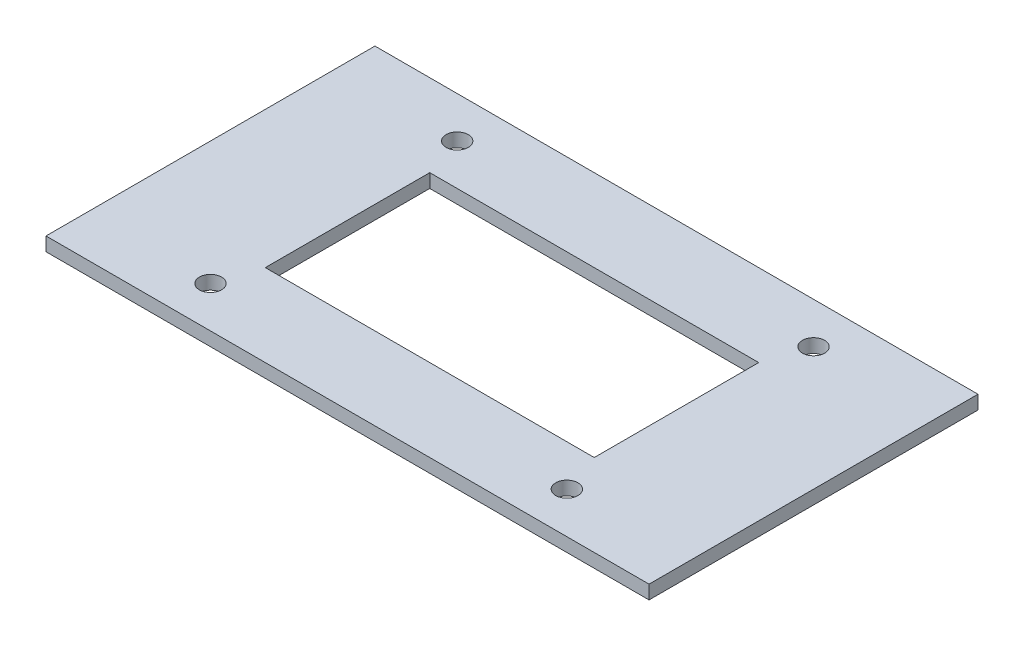
ISO-10303-21;
HEADER;
FILE_DESCRIPTION(('STEP AP214'),'2;1');
FILE_NAME('part.step','',(''),(''),'','','');
FILE_SCHEMA(('AUTOMOTIVE_DESIGN { 1 0 10303 214 1 1 1 1 }'));
ENDSEC;
DATA;
#1=APPLICATION_CONTEXT('core data for automotive mechanical design processes');
#2=APPLICATION_PROTOCOL_DEFINITION('international standard','automotive_design',2000,#1);
#3=PRODUCT_CONTEXT('',#1,'mechanical');
#4=PRODUCT('Part','Part','',(#3));
#5=PRODUCT_RELATED_PRODUCT_CATEGORY('part','',(#4));
#6=PRODUCT_DEFINITION_FORMATION('','',#4);
#7=PRODUCT_DEFINITION_CONTEXT('part definition',#1,'design');
#8=PRODUCT_DEFINITION('design','',#6,#7);
#9=PRODUCT_DEFINITION_SHAPE('','',#8);
#10=(LENGTH_UNIT() NAMED_UNIT(*) SI_UNIT(.MILLI.,.METRE.));
#11=(NAMED_UNIT(*) PLANE_ANGLE_UNIT() SI_UNIT($,.RADIAN.));
#12=(NAMED_UNIT(*) SI_UNIT($,.STERADIAN.) SOLID_ANGLE_UNIT());
#13=UNCERTAINTY_MEASURE_WITH_UNIT(LENGTH_MEASURE(1.E-05),#10,'distance_accuracy_value','');
#14=(GEOMETRIC_REPRESENTATION_CONTEXT(3) GLOBAL_UNCERTAINTY_ASSIGNED_CONTEXT((#13)) GLOBAL_UNIT_ASSIGNED_CONTEXT((#10,
#11,#12)) REPRESENTATION_CONTEXT('',''));
#15=CARTESIAN_POINT('',(0.,0.,0.));
#16=DIRECTION('',(0.,0.,1.));
#17=DIRECTION('',(1.,0.,0.));
#18=AXIS2_PLACEMENT_3D('',#15,#16,#17);
#19=CARTESIAN_POINT('',(-59.5002245820675,12.7,-46.8644242003918));
#20=DIRECTION('',(1.,0.,0.));
#21=DIRECTION('',(0.,0.,-1.));
#22=AXIS2_PLACEMENT_3D('',#19,#20,#21);
#23=PLANE('',#22);
#24=DIRECTION('',(0.,0.,1.));
#25=VECTOR('',#24,1.);
#26=CARTESIAN_POINT('',(-59.5002245820675,0.,-46.8644242003918));
#27=LINE('',#26,#25);
#28=CARTESIAN_POINT('',(-59.5002245820675,0.,-46.8644242003918));
#29=VERTEX_POINT('',#28);
#30=CARTESIAN_POINT('',(-59.5002245820674,0.,257.935575799608));
#31=VERTEX_POINT('',#30);
#32=EDGE_CURVE('E136',#29,#31,#27,.T.);
#33=ORIENTED_EDGE('',*,*,#32,.T.);
#34=DIRECTION('',(0.,-1.,0.));
#35=VECTOR('',#34,1.);
#36=CARTESIAN_POINT('',(-59.5002245820674,12.7,257.935575799608));
#37=LINE('',#36,#35);
#38=CARTESIAN_POINT('',(-59.5002245820674,12.7,257.935575799608));
#39=VERTEX_POINT('',#38);
#40=EDGE_CURVE('E11',#39,#31,#37,.T.);
#41=ORIENTED_EDGE('',*,*,#40,.F.);
#42=DIRECTION('',(0.,0.,1.));
#43=VECTOR('',#42,1.);
#44=CARTESIAN_POINT('',(-59.5002245820675,12.7,-46.8644242003918));
#45=LINE('',#44,#43);
#46=CARTESIAN_POINT('',(-59.5002245820675,12.7,-46.8644242003918));
#47=VERTEX_POINT('',#46);
#48=EDGE_CURVE('E140',#47,#39,#45,.T.);
#49=ORIENTED_EDGE('',*,*,#48,.F.);
#50=DIRECTION('',(0.,-1.,0.));
#51=VECTOR('',#50,1.);
#52=CARTESIAN_POINT('',(-59.5002245820675,12.7,-46.8644242003918));
#53=LINE('',#52,#51);
#54=EDGE_CURVE('E150',#47,#29,#53,.T.);
#55=ORIENTED_EDGE('',*,*,#54,.T.);
#56=EDGE_LOOP('',(#33,#41,#49,#55));
#57=FACE_BOUND('',#56,.T.);
#58=ADVANCED_FACE('F35',(#57),#23,.F.);
#59=CARTESIAN_POINT('',(-59.5002245820674,12.7,257.935575799608));
#60=DIRECTION('',(0.,0.,-1.));
#61=DIRECTION('',(-1.,0.,0.));
#62=AXIS2_PLACEMENT_3D('',#59,#60,#61);
#63=PLANE('',#62);
#64=DIRECTION('',(1.,0.,0.));
#65=VECTOR('',#64,1.);
#66=CARTESIAN_POINT('',(-59.5002245820674,0.,257.935575799608));
#67=LINE('',#66,#65);
#68=CARTESIAN_POINT('',(499.299775417932,0.,257.935575799608));
#69=VERTEX_POINT('',#68);
#70=EDGE_CURVE('E153',#31,#69,#67,.T.);
#71=ORIENTED_EDGE('',*,*,#70,.T.);
#72=DIRECTION('',(0.,-1.,0.));
#73=VECTOR('',#72,1.);
#74=CARTESIAN_POINT('',(499.299775417932,12.7,257.935575799608));
#75=LINE('',#74,#73);
#76=CARTESIAN_POINT('',(499.299775417932,12.7,257.935575799608));
#77=VERTEX_POINT('',#76);
#78=EDGE_CURVE('E42',#77,#69,#75,.T.);
#79=ORIENTED_EDGE('',*,*,#78,.F.);
#80=DIRECTION('',(1.,0.,0.));
#81=VECTOR('',#80,1.);
#82=CARTESIAN_POINT('',(-59.5002245820674,12.7,257.935575799608));
#83=LINE('',#82,#81);
#84=EDGE_CURVE('E143',#39,#77,#83,.T.);
#85=ORIENTED_EDGE('',*,*,#84,.F.);
#86=ORIENTED_EDGE('',*,*,#40,.T.);
#87=EDGE_LOOP('',(#71,#79,#85,#86));
#88=FACE_BOUND('',#87,.T.);
#89=ADVANCED_FACE('F181',(#88),#63,.F.);
#90=CARTESIAN_POINT('',(499.299775417932,12.7,-46.8644242003918));
#91=DIRECTION('',(-1.,0.,0.));
#92=DIRECTION('',(0.,0.,1.));
#93=AXIS2_PLACEMENT_3D('',#90,#91,#92);
#94=PLANE('',#93);
#95=DIRECTION('',(0.,0.,-1.));
#96=VECTOR('',#95,1.);
#97=CARTESIAN_POINT('',(499.299775417932,0.,-46.8644242003918));
#98=LINE('',#97,#96);
#99=CARTESIAN_POINT('',(499.299775417932,0.,-46.8644242003918));
#100=VERTEX_POINT('',#99);
#101=EDGE_CURVE('E155',#69,#100,#98,.T.);
#102=ORIENTED_EDGE('',*,*,#101,.T.);
#103=DIRECTION('',(0.,-1.,0.));
#104=VECTOR('',#103,1.);
#105=CARTESIAN_POINT('',(499.299775417932,12.7,-46.8644242003918));
#106=LINE('',#105,#104);
#107=CARTESIAN_POINT('',(499.299775417932,12.7,-46.8644242003918));
#108=VERTEX_POINT('',#107);
#109=EDGE_CURVE('E160',#108,#100,#106,.T.);
#110=ORIENTED_EDGE('',*,*,#109,.F.);
#111=DIRECTION('',(0.,0.,-1.));
#112=VECTOR('',#111,1.);
#113=CARTESIAN_POINT('',(499.299775417932,12.7,-46.8644242003918));
#114=LINE('',#113,#112);
#115=EDGE_CURVE('E146',#77,#108,#114,.T.);
#116=ORIENTED_EDGE('',*,*,#115,.F.);
#117=ORIENTED_EDGE('',*,*,#78,.T.);
#118=EDGE_LOOP('',(#102,#110,#116,#117));
#119=FACE_BOUND('',#118,.T.);
#120=ADVANCED_FACE('F167',(#119),#94,.F.);
#121=CARTESIAN_POINT('',(-59.5002245820675,12.7,-46.8644242003918));
#122=DIRECTION('',(0.,0.,1.));
#123=DIRECTION('',(1.,0.,0.));
#124=AXIS2_PLACEMENT_3D('',#121,#122,#123);
#125=PLANE('',#124);
#126=DIRECTION('',(-1.,0.,0.));
#127=VECTOR('',#126,1.);
#128=CARTESIAN_POINT('',(-59.5002245820675,0.,-46.8644242003918));
#129=LINE('',#128,#127);
#130=EDGE_CURVE('E144',#100,#29,#129,.T.);
#131=ORIENTED_EDGE('',*,*,#130,.T.);
#132=ORIENTED_EDGE('',*,*,#54,.F.);
#133=DIRECTION('',(-1.,0.,0.));
#134=VECTOR('',#133,1.);
#135=CARTESIAN_POINT('',(-59.5002245820675,12.7,-46.8644242003918));
#136=LINE('',#135,#134);
#137=EDGE_CURVE('E148',#108,#47,#136,.T.);
#138=ORIENTED_EDGE('',*,*,#137,.F.);
#139=ORIENTED_EDGE('',*,*,#109,.T.);
#140=EDGE_LOOP('',(#131,#132,#138,#139));
#141=FACE_BOUND('',#140,.T.);
#142=ADVANCED_FACE('F174',(#141),#125,.F.);
#143=CARTESIAN_POINT('',(0.,12.7,0.));
#144=DIRECTION('',(0.,1.,0.));
#145=DIRECTION('',(0.,0.,1.));
#146=AXIS2_PLACEMENT_3D('',#143,#144,#145);
#147=PLANE('',#146);
#148=CARTESIAN_POINT('',(384.999775417932,12.7,219.835575799608));
#149=DIRECTION('',(0.,1.,0.));
#150=DIRECTION('',(0.,0.,1.));
#151=AXIS2_PLACEMENT_3D('',#148,#149,#150);
#152=CIRCLE('',#151,10.287);
#153=CARTESIAN_POINT('',(384.999775417932,12.7,230.122575799608));
#154=VERTEX_POINT('',#153);
#155=EDGE_CURVE('E231',#154,#154,#152,.T.);
#156=ORIENTED_EDGE('',*,*,#155,.F.);
#157=EDGE_LOOP('',(#156));
#158=FACE_BOUND('',#157,.T.);
#159=CARTESIAN_POINT('',(54.7997754179325,12.7,219.835575799608));
#160=DIRECTION('',(0.,1.,0.));
#161=DIRECTION('',(0.,0.,1.));
#162=AXIS2_PLACEMENT_3D('',#159,#160,#161);
#163=CIRCLE('',#162,10.287);
#164=CARTESIAN_POINT('',(54.7997754179325,12.7,230.122575799608));
#165=VERTEX_POINT('',#164);
#166=EDGE_CURVE('E233',#165,#165,#163,.T.);
#167=ORIENTED_EDGE('',*,*,#166,.F.);
#168=EDGE_LOOP('',(#167));
#169=FACE_BOUND('',#168,.T.);
#170=CARTESIAN_POINT('',(384.999775417932,12.7,-8.7644242003917));
#171=DIRECTION('',(0.,1.,0.));
#172=DIRECTION('',(0.,0.,1.));
#173=AXIS2_PLACEMENT_3D('',#170,#171,#172);
#174=CIRCLE('',#173,10.287);
#175=CARTESIAN_POINT('',(384.999775417932,12.7,1.5225757996083));
#176=VERTEX_POINT('',#175);
#177=EDGE_CURVE('E239',#176,#176,#174,.T.);
#178=ORIENTED_EDGE('',*,*,#177,.F.);
#179=EDGE_LOOP('',(#178));
#180=FACE_BOUND('',#179,.T.);
#181=CARTESIAN_POINT('',(54.7997754179326,12.7,-8.76442420039183));
#182=DIRECTION('',(0.,1.,0.));
#183=DIRECTION('',(0.,0.,1.));
#184=AXIS2_PLACEMENT_3D('',#181,#182,#183);
#185=CIRCLE('',#184,10.287);
#186=CARTESIAN_POINT('',(54.7997754179326,12.7,1.52257579960818));
#187=VERTEX_POINT('',#186);
#188=EDGE_CURVE('E123',#187,#187,#185,.T.);
#189=ORIENTED_EDGE('',*,*,#188,.F.);
#190=EDGE_LOOP('',(#189));
#191=FACE_BOUND('',#190,.T.);
#192=DIRECTION('',(0.,0.,-1.));
#193=VECTOR('',#192,1.);
#194=CARTESIAN_POINT('',(372.299775417933,12.7,181.735575799608));
#195=LINE('',#194,#193);
#196=CARTESIAN_POINT('',(372.299775417933,12.7,181.735575799608));
#197=VERTEX_POINT('',#196);
#198=CARTESIAN_POINT('',(372.299775417933,12.7,29.3355757996083));
#199=VERTEX_POINT('',#198);
#200=EDGE_CURVE('E49',#197,#199,#195,.T.);
#201=ORIENTED_EDGE('',*,*,#200,.F.);
#202=DIRECTION('',(1.,0.,0.));
#203=VECTOR('',#202,1.);
#204=CARTESIAN_POINT('',(67.4997754179325,12.7,181.735575799608));
#205=LINE('',#204,#203);
#206=CARTESIAN_POINT('',(67.4997754179325,12.7,181.735575799608));
#207=VERTEX_POINT('',#206);
#208=EDGE_CURVE('E117',#207,#197,#205,.T.);
#209=ORIENTED_EDGE('',*,*,#208,.F.);
#210=DIRECTION('',(0.,0.,1.));
#211=VECTOR('',#210,1.);
#212=CARTESIAN_POINT('',(67.4997754179325,12.7,181.735575799608));
#213=LINE('',#212,#211);
#214=CARTESIAN_POINT('',(67.4997754179325,12.7,29.3355757996083));
#215=VERTEX_POINT('',#214);
#216=EDGE_CURVE('E120',#215,#207,#213,.T.);
#217=ORIENTED_EDGE('',*,*,#216,.F.);
#218=DIRECTION('',(-1.,0.,0.));
#219=VECTOR('',#218,1.);
#220=CARTESIAN_POINT('',(67.4997754179325,12.7,29.3355757996083));
#221=LINE('',#220,#219);
#222=EDGE_CURVE('E129',#199,#215,#221,.T.);
#223=ORIENTED_EDGE('',*,*,#222,.F.);
#224=EDGE_LOOP('',(#201,#209,#217,#223));
#225=FACE_BOUND('',#224,.T.);
#226=ORIENTED_EDGE('',*,*,#48,.T.);
#227=ORIENTED_EDGE('',*,*,#84,.T.);
#228=ORIENTED_EDGE('',*,*,#115,.T.);
#229=ORIENTED_EDGE('',*,*,#137,.T.);
#230=EDGE_LOOP('',(#226,#227,#228,#229));
#231=FACE_BOUND('',#230,.T.);
#232=ADVANCED_FACE('F180',(#158,#169,#180,#191,#225,#231),#147,.T.);
#233=CARTESIAN_POINT('',(0.,0.,0.));
#234=DIRECTION('',(0.,1.,0.));
#235=DIRECTION('',(0.,0.,1.));
#236=AXIS2_PLACEMENT_3D('',#233,#234,#235);
#237=PLANE('',#236);
#238=CARTESIAN_POINT('',(384.999775417932,0.,219.835575799608));
#239=DIRECTION('',(0.,1.,0.));
#240=DIRECTION('',(0.,0.,1.));
#241=AXIS2_PLACEMENT_3D('',#238,#239,#240);
#242=CIRCLE('',#241,10.287);
#243=CARTESIAN_POINT('',(384.999775417932,0.,230.122575799608));
#244=VERTEX_POINT('',#243);
#245=EDGE_CURVE('E228',#244,#244,#242,.T.);
#246=ORIENTED_EDGE('',*,*,#245,.T.);
#247=EDGE_LOOP('',(#246));
#248=FACE_BOUND('',#247,.T.);
#249=CARTESIAN_POINT('',(54.7997754179325,0.,219.835575799608));
#250=DIRECTION('',(0.,1.,0.));
#251=DIRECTION('',(0.,0.,1.));
#252=AXIS2_PLACEMENT_3D('',#249,#250,#251);
#253=CIRCLE('',#252,10.287);
#254=CARTESIAN_POINT('',(54.7997754179325,0.,230.122575799608));
#255=VERTEX_POINT('',#254);
#256=EDGE_CURVE('E236',#255,#255,#253,.T.);
#257=ORIENTED_EDGE('',*,*,#256,.T.);
#258=EDGE_LOOP('',(#257));
#259=FACE_BOUND('',#258,.T.);
#260=CARTESIAN_POINT('',(384.999775417932,0.,-8.7644242003917));
#261=DIRECTION('',(0.,1.,0.));
#262=DIRECTION('',(0.,0.,1.));
#263=AXIS2_PLACEMENT_3D('',#260,#261,#262);
#264=CIRCLE('',#263,10.287);
#265=CARTESIAN_POINT('',(384.999775417932,0.,1.5225757996083));
#266=VERTEX_POINT('',#265);
#267=EDGE_CURVE('E242',#266,#266,#264,.T.);
#268=ORIENTED_EDGE('',*,*,#267,.T.);
#269=EDGE_LOOP('',(#268));
#270=FACE_BOUND('',#269,.T.);
#271=CARTESIAN_POINT('',(54.7997754179326,0.,-8.76442420039183));
#272=DIRECTION('',(0.,1.,0.));
#273=DIRECTION('',(0.,0.,1.));
#274=AXIS2_PLACEMENT_3D('',#271,#272,#273);
#275=CIRCLE('',#274,10.287);
#276=CARTESIAN_POINT('',(54.7997754179326,0.,1.52257579960818));
#277=VERTEX_POINT('',#276);
#278=EDGE_CURVE('E130',#277,#277,#275,.T.);
#279=ORIENTED_EDGE('',*,*,#278,.T.);
#280=EDGE_LOOP('',(#279));
#281=FACE_BOUND('',#280,.T.);
#282=DIRECTION('',(1.,0.,0.));
#283=VECTOR('',#282,1.);
#284=CARTESIAN_POINT('',(67.4997754179325,0.,181.735575799608));
#285=LINE('',#284,#283);
#286=CARTESIAN_POINT('',(67.4997754179325,0.,181.735575799608));
#287=VERTEX_POINT('',#286);
#288=CARTESIAN_POINT('',(372.299775417933,0.,181.735575799608));
#289=VERTEX_POINT('',#288);
#290=EDGE_CURVE('E107',#287,#289,#285,.T.);
#291=ORIENTED_EDGE('',*,*,#290,.T.);
#292=DIRECTION('',(0.,0.,-1.));
#293=VECTOR('',#292,1.);
#294=CARTESIAN_POINT('',(372.299775417933,0.,181.735575799608));
#295=LINE('',#294,#293);
#296=CARTESIAN_POINT('',(372.299775417933,0.,29.3355757996083));
#297=VERTEX_POINT('',#296);
#298=EDGE_CURVE('E101',#289,#297,#295,.T.);
#299=ORIENTED_EDGE('',*,*,#298,.T.);
#300=DIRECTION('',(-1.,0.,0.));
#301=VECTOR('',#300,1.);
#302=CARTESIAN_POINT('',(67.4997754179325,0.,29.3355757996083));
#303=LINE('',#302,#301);
#304=CARTESIAN_POINT('',(67.4997754179325,0.,29.3355757996083));
#305=VERTEX_POINT('',#304);
#306=EDGE_CURVE('E110',#297,#305,#303,.T.);
#307=ORIENTED_EDGE('',*,*,#306,.T.);
#308=DIRECTION('',(0.,0.,1.));
#309=VECTOR('',#308,1.);
#310=CARTESIAN_POINT('',(67.4997754179325,0.,181.735575799608));
#311=LINE('',#310,#309);
#312=EDGE_CURVE('E57',#305,#287,#311,.T.);
#313=ORIENTED_EDGE('',*,*,#312,.T.);
#314=EDGE_LOOP('',(#291,#299,#307,#313));
#315=FACE_BOUND('',#314,.T.);
#316=ORIENTED_EDGE('',*,*,#32,.F.);
#317=ORIENTED_EDGE('',*,*,#130,.F.);
#318=ORIENTED_EDGE('',*,*,#101,.F.);
#319=ORIENTED_EDGE('',*,*,#70,.F.);
#320=EDGE_LOOP('',(#316,#317,#318,#319));
#321=FACE_BOUND('',#320,.T.);
#322=ADVANCED_FACE('F114',(#248,#259,#270,#281,#315,#321),#237,.F.);
#323=CARTESIAN_POINT('',(372.299775417933,0.,181.735575799608));
#324=DIRECTION('',(1.,0.,0.));
#325=DIRECTION('',(0.,0.,-1.));
#326=AXIS2_PLACEMENT_3D('',#323,#324,#325);
#327=PLANE('',#326);
#328=ORIENTED_EDGE('',*,*,#200,.T.);
#329=DIRECTION('',(0.,1.,0.));
#330=VECTOR('',#329,1.);
#331=CARTESIAN_POINT('',(372.299775417933,0.,29.3355757996083));
#332=LINE('',#331,#330);
#333=EDGE_CURVE('E97',#297,#199,#332,.T.);
#334=ORIENTED_EDGE('',*,*,#333,.F.);
#335=ORIENTED_EDGE('',*,*,#298,.F.);
#336=DIRECTION('',(0.,1.,0.));
#337=VECTOR('',#336,1.);
#338=CARTESIAN_POINT('',(372.299775417933,0.,181.735575799608));
#339=LINE('',#338,#337);
#340=EDGE_CURVE('E134',#289,#197,#339,.T.);
#341=ORIENTED_EDGE('',*,*,#340,.T.);
#342=EDGE_LOOP('',(#328,#334,#335,#341));
#343=FACE_BOUND('',#342,.T.);
#344=ADVANCED_FACE('F99',(#343),#327,.F.);
#345=CARTESIAN_POINT('',(67.4997754179325,0.,181.735575799608));
#346=DIRECTION('',(0.,0.,1.));
#347=DIRECTION('',(1.,0.,0.));
#348=AXIS2_PLACEMENT_3D('',#345,#346,#347);
#349=PLANE('',#348);
#350=ORIENTED_EDGE('',*,*,#208,.T.);
#351=ORIENTED_EDGE('',*,*,#340,.F.);
#352=ORIENTED_EDGE('',*,*,#290,.F.);
#353=DIRECTION('',(0.,1.,0.));
#354=VECTOR('',#353,1.);
#355=CARTESIAN_POINT('',(67.4997754179325,0.,181.735575799608));
#356=LINE('',#355,#354);
#357=EDGE_CURVE('E137',#287,#207,#356,.T.);
#358=ORIENTED_EDGE('',*,*,#357,.T.);
#359=EDGE_LOOP('',(#350,#351,#352,#358));
#360=FACE_BOUND('',#359,.T.);
#361=ADVANCED_FACE('F199',(#360),#349,.F.);
#362=CARTESIAN_POINT('',(67.4997754179325,0.,181.735575799608));
#363=DIRECTION('',(-1.,0.,0.));
#364=DIRECTION('',(0.,0.,1.));
#365=AXIS2_PLACEMENT_3D('',#362,#363,#364);
#366=PLANE('',#365);
#367=ORIENTED_EDGE('',*,*,#216,.T.);
#368=ORIENTED_EDGE('',*,*,#357,.F.);
#369=ORIENTED_EDGE('',*,*,#312,.F.);
#370=DIRECTION('',(0.,1.,0.));
#371=VECTOR('',#370,1.);
#372=CARTESIAN_POINT('',(67.4997754179325,0.,29.3355757996083));
#373=LINE('',#372,#371);
#374=EDGE_CURVE('E106',#305,#215,#373,.T.);
#375=ORIENTED_EDGE('',*,*,#374,.T.);
#376=EDGE_LOOP('',(#367,#368,#369,#375));
#377=FACE_BOUND('',#376,.T.);
#378=ADVANCED_FACE('F203',(#377),#366,.F.);
#379=CARTESIAN_POINT('',(67.4997754179325,0.,29.3355757996083));
#380=DIRECTION('',(0.,0.,-1.));
#381=DIRECTION('',(-1.,0.,0.));
#382=AXIS2_PLACEMENT_3D('',#379,#380,#381);
#383=PLANE('',#382);
#384=ORIENTED_EDGE('',*,*,#222,.T.);
#385=ORIENTED_EDGE('',*,*,#374,.F.);
#386=ORIENTED_EDGE('',*,*,#306,.F.);
#387=ORIENTED_EDGE('',*,*,#333,.T.);
#388=EDGE_LOOP('',(#384,#385,#386,#387));
#389=FACE_BOUND('',#388,.T.);
#390=ADVANCED_FACE('F111',(#389),#383,.F.);
#391=CARTESIAN_POINT('',(54.7997754179326,0.,-8.76442420039183));
#392=DIRECTION('',(0.,1.,0.));
#393=DIRECTION('',(0.,0.,1.));
#394=AXIS2_PLACEMENT_3D('',#391,#392,#393);
#395=CYLINDRICAL_SURFACE('',#394,10.287);
#396=ORIENTED_EDGE('',*,*,#278,.F.);
#397=EDGE_LOOP('',(#396));
#398=FACE_BOUND('',#397,.T.);
#399=ORIENTED_EDGE('',*,*,#188,.T.);
#400=EDGE_LOOP('',(#399));
#401=FACE_BOUND('',#400,.T.);
#402=ADVANCED_FACE('F202',(#398,#401),#395,.F.);
#403=CARTESIAN_POINT('',(384.999775417932,0.,-8.7644242003917));
#404=DIRECTION('',(0.,1.,0.));
#405=DIRECTION('',(0.,0.,1.));
#406=AXIS2_PLACEMENT_3D('',#403,#404,#405);
#407=CYLINDRICAL_SURFACE('',#406,10.287);
#408=ORIENTED_EDGE('',*,*,#267,.F.);
#409=EDGE_LOOP('',(#408));
#410=FACE_BOUND('',#409,.T.);
#411=ORIENTED_EDGE('',*,*,#177,.T.);
#412=EDGE_LOOP('',(#411));
#413=FACE_BOUND('',#412,.T.);
#414=ADVANCED_FACE('F211',(#410,#413),#407,.F.);
#415=CARTESIAN_POINT('',(54.7997754179325,0.,219.835575799608));
#416=DIRECTION('',(0.,1.,0.));
#417=DIRECTION('',(0.,0.,1.));
#418=AXIS2_PLACEMENT_3D('',#415,#416,#417);
#419=CYLINDRICAL_SURFACE('',#418,10.287);
#420=ORIENTED_EDGE('',*,*,#256,.F.);
#421=EDGE_LOOP('',(#420));
#422=FACE_BOUND('',#421,.T.);
#423=ORIENTED_EDGE('',*,*,#166,.T.);
#424=EDGE_LOOP('',(#423));
#425=FACE_BOUND('',#424,.T.);
#426=ADVANCED_FACE('F215',(#422,#425),#419,.F.);
#427=CARTESIAN_POINT('',(384.999775417932,0.,219.835575799608));
#428=DIRECTION('',(0.,1.,0.));
#429=DIRECTION('',(0.,0.,1.));
#430=AXIS2_PLACEMENT_3D('',#427,#428,#429);
#431=CYLINDRICAL_SURFACE('',#430,10.287);
#432=ORIENTED_EDGE('',*,*,#245,.F.);
#433=EDGE_LOOP('',(#432));
#434=FACE_BOUND('',#433,.T.);
#435=ORIENTED_EDGE('',*,*,#155,.T.);
#436=EDGE_LOOP('',(#435));
#437=FACE_BOUND('',#436,.T.);
#438=ADVANCED_FACE('F219',(#434,#437),#431,.F.);
#439=CLOSED_SHELL('',(#58,#89,#120,#142,#232,#322,#344,#361,#378,#390,#402,#414,#426,#438));
#440=MANIFOLD_SOLID_BREP('B2',#439);
#441=ADVANCED_BREP_SHAPE_REPRESENTATION('',(#18,#440),#14);
#442=SHAPE_DEFINITION_REPRESENTATION(#9,#441);
ENDSEC;
END-ISO-10303-21;
